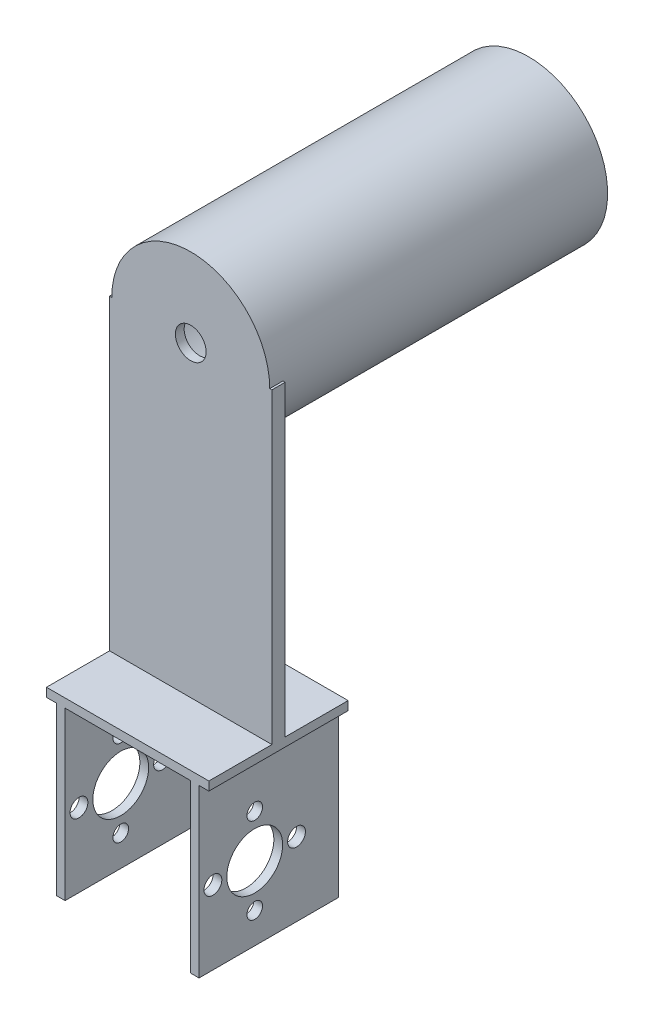
ISO-10303-21;
HEADER;
FILE_DESCRIPTION(('STEP AP214'),'2;1');
FILE_NAME('part.step','',(''),(''),'','','');
FILE_SCHEMA(('AUTOMOTIVE_DESIGN { 1 0 10303 214 1 1 1 1 }'));
ENDSEC;
DATA;
#1=APPLICATION_CONTEXT('core data for automotive mechanical design processes');
#2=APPLICATION_PROTOCOL_DEFINITION('international standard','automotive_design',2000,#1);
#3=PRODUCT_CONTEXT('',#1,'mechanical');
#4=PRODUCT('Part','Part','',(#3));
#5=PRODUCT_RELATED_PRODUCT_CATEGORY('part','',(#4));
#6=PRODUCT_DEFINITION_FORMATION('','',#4);
#7=PRODUCT_DEFINITION_CONTEXT('part definition',#1,'design');
#8=PRODUCT_DEFINITION('design','',#6,#7);
#9=PRODUCT_DEFINITION_SHAPE('','',#8);
#10=(LENGTH_UNIT() NAMED_UNIT(*) SI_UNIT(.MILLI.,.METRE.));
#11=(NAMED_UNIT(*) PLANE_ANGLE_UNIT() SI_UNIT($,.RADIAN.));
#12=(NAMED_UNIT(*) SI_UNIT($,.STERADIAN.) SOLID_ANGLE_UNIT());
#13=UNCERTAINTY_MEASURE_WITH_UNIT(LENGTH_MEASURE(1.E-05),#10,'distance_accuracy_value','');
#14=(GEOMETRIC_REPRESENTATION_CONTEXT(3) GLOBAL_UNCERTAINTY_ASSIGNED_CONTEXT((#13)) GLOBAL_UNIT_ASSIGNED_CONTEXT((#10,
#11,#12)) REPRESENTATION_CONTEXT('',''));
#15=CARTESIAN_POINT('',(0.,0.,0.));
#16=DIRECTION('',(0.,0.,1.));
#17=DIRECTION('',(1.,0.,0.));
#18=AXIS2_PLACEMENT_3D('',#15,#16,#17);
#19=CARTESIAN_POINT('',(0.,110.,0.));
#20=DIRECTION('',(0.,-1.,0.));
#21=DIRECTION('',(0.,0.,-1.));
#22=AXIS2_PLACEMENT_3D('',#19,#20,#21);
#23=PLANE('',#22);
#24=DIRECTION('',(1.,0.,0.));
#25=VECTOR('',#24,1.);
#26=CARTESIAN_POINT('',(-5.30632757811611,110.,16.162349726776));
#27=LINE('',#26,#25);
#28=CARTESIAN_POINT('',(-5.30632757811611,110.,16.162349726776));
#29=VERTEX_POINT('',#28);
#30=CARTESIAN_POINT('',(-4.80632757811611,110.,16.162349726776));
#31=VERTEX_POINT('',#30);
#32=EDGE_CURVE('E53',#29,#31,#27,.T.);
#33=ORIENTED_EDGE('',*,*,#32,.T.);
#34=DIRECTION('',(0.,0.,-1.));
#35=VECTOR('',#34,1.);
#36=CARTESIAN_POINT('',(-4.80632757811611,110.,16.162349726776));
#37=LINE('',#36,#35);
#38=CARTESIAN_POINT('',(-4.80632757811611,110.,13.162349726776));
#39=VERTEX_POINT('',#38);
#40=EDGE_CURVE('E11',#31,#39,#37,.T.);
#41=ORIENTED_EDGE('',*,*,#40,.T.);
#42=DIRECTION('',(-1.,0.,0.));
#43=VECTOR('',#42,1.);
#44=CARTESIAN_POINT('',(-5.30632757811611,110.,13.162349726776));
#45=LINE('',#44,#43);
#46=CARTESIAN_POINT('',(-5.30632757811611,110.,13.162349726776));
#47=VERTEX_POINT('',#46);
#48=EDGE_CURVE('E193',#39,#47,#45,.T.);
#49=ORIENTED_EDGE('',*,*,#48,.T.);
#50=DIRECTION('',(0.,0.,1.));
#51=VECTOR('',#50,1.);
#52=CARTESIAN_POINT('',(-5.30632757811611,110.,13.162349726776));
#53=LINE('',#52,#51);
#54=EDGE_CURVE('E170',#47,#29,#53,.T.);
#55=ORIENTED_EDGE('',*,*,#54,.T.);
#56=EDGE_LOOP('',(#33,#41,#49,#55));
#57=FACE_BOUND('',#56,.T.);
#58=ADVANCED_FACE('F37',(#57),#23,.F.);
#59=CARTESIAN_POINT('',(0.,40.,0.));
#60=DIRECTION('',(0.,1.,0.));
#61=DIRECTION('',(0.,0.,1.));
#62=AXIS2_PLACEMENT_3D('',#59,#60,#61);
#63=PLANE('',#62);
#64=DIRECTION('',(-1.,0.,0.));
#65=VECTOR('',#64,1.);
#66=CARTESIAN_POINT('',(-5.30632757811611,40.,13.162349726776));
#67=LINE('',#66,#65);
#68=CARTESIAN_POINT('',(31.6936724218839,40.,13.162349726776));
#69=VERTEX_POINT('',#68);
#70=CARTESIAN_POINT('',(-5.30632757811611,40.,13.162349726776));
#71=VERTEX_POINT('',#70);
#72=EDGE_CURVE('E185',#69,#71,#67,.T.);
#73=ORIENTED_EDGE('',*,*,#72,.F.);
#74=DIRECTION('',(0.,0.,-1.));
#75=VECTOR('',#74,1.);
#76=CARTESIAN_POINT('',(31.6936724218839,40.,-1.20765027322405));
#77=LINE('',#76,#75);
#78=CARTESIAN_POINT('',(31.6936724218839,40.,-1.20765027322405));
#79=VERTEX_POINT('',#78);
#80=EDGE_CURVE('E252',#69,#79,#77,.T.);
#81=ORIENTED_EDGE('',*,*,#80,.T.);
#82=DIRECTION('',(-1.,0.,0.));
#83=VECTOR('',#82,1.);
#84=CARTESIAN_POINT('',(-3.07432757811612,40.,-1.20765027322404));
#85=LINE('',#84,#83);
#86=CARTESIAN_POINT('',(-5.30632757811611,40.,-1.20765027322404));
#87=VERTEX_POINT('',#86);
#88=EDGE_CURVE('E273',#79,#87,#85,.T.);
#89=ORIENTED_EDGE('',*,*,#88,.T.);
#90=DIRECTION('',(0.,0.,1.));
#91=VECTOR('',#90,1.);
#92=CARTESIAN_POINT('',(-5.30632757811611,40.,-1.20765027322404));
#93=LINE('',#92,#91);
#94=EDGE_CURVE('E250',#87,#71,#93,.T.);
#95=ORIENTED_EDGE('',*,*,#94,.T.);
#96=EDGE_LOOP('',(#73,#81,#89,#95));
#97=FACE_BOUND('',#96,.T.);
#98=ADVANCED_FACE('F370',(#97),#63,.T.);
#99=CARTESIAN_POINT('',(0.,38.,0.));
#100=DIRECTION('',(0.,1.,0.));
#101=DIRECTION('',(0.,0.,1.));
#102=AXIS2_PLACEMENT_3D('',#99,#100,#101);
#103=PLANE('',#102);
#104=DIRECTION('',(0.,0.,-1.));
#105=VECTOR('',#104,1.);
#106=CARTESIAN_POINT('',(27.4536724218839,38.,0.));
#107=LINE('',#106,#105);
#108=CARTESIAN_POINT('',(27.4536724218839,38.,30.532349726776));
#109=VERTEX_POINT('',#108);
#110=CARTESIAN_POINT('',(27.4536724218839,38.,-1.20765027322405));
#111=VERTEX_POINT('',#110);
#112=EDGE_CURVE('E179',#109,#111,#107,.T.);
#113=ORIENTED_EDGE('',*,*,#112,.F.);
#114=DIRECTION('',(1.,0.,0.));
#115=VECTOR('',#114,1.);
#116=CARTESIAN_POINT('',(-5.30632757811611,38.,30.532349726776));
#117=LINE('',#116,#115);
#118=CARTESIAN_POINT('',(-1.07432757811612,38.,30.532349726776));
#119=VERTEX_POINT('',#118);
#120=EDGE_CURVE('E241',#119,#109,#117,.T.);
#121=ORIENTED_EDGE('',*,*,#120,.F.);
#122=DIRECTION('',(0.,0.,-1.));
#123=VECTOR('',#122,1.);
#124=CARTESIAN_POINT('',(-1.07432757811612,38.,-1.20765027322404));
#125=LINE('',#124,#123);
#126=CARTESIAN_POINT('',(-1.07432757811612,38.,-1.20765027322404));
#127=VERTEX_POINT('',#126);
#128=EDGE_CURVE('E257',#119,#127,#125,.T.);
#129=ORIENTED_EDGE('',*,*,#128,.T.);
#130=DIRECTION('',(-1.,0.,0.));
#131=VECTOR('',#130,1.);
#132=CARTESIAN_POINT('',(-5.30632757811611,38.,-1.20765027322404));
#133=LINE('',#132,#131);
#134=EDGE_CURVE('E249',#111,#127,#133,.T.);
#135=ORIENTED_EDGE('',*,*,#134,.F.);
#136=EDGE_LOOP('',(#113,#121,#129,#135));
#137=FACE_BOUND('',#136,.T.);
#138=ADVANCED_FACE('F374',(#137),#103,.F.);
#139=DIRECTION('',(0.,0.,1.));
#140=VECTOR('',#139,1.);
#141=CARTESIAN_POINT('',(29.4536724218839,38.,0.));
#142=LINE('',#141,#140);
#143=CARTESIAN_POINT('',(29.4536724218839,38.,-1.20765027322405));
#144=VERTEX_POINT('',#143);
#145=CARTESIAN_POINT('',(29.4536724218839,38.,30.532349726776));
#146=VERTEX_POINT('',#145);
#147=EDGE_CURVE('E294',#144,#146,#142,.T.);
#148=ORIENTED_EDGE('',*,*,#147,.F.);
#149=CARTESIAN_POINT('',(31.6936724218839,38.,-1.20765027322405));
#150=VERTEX_POINT('',#149);
#151=EDGE_CURVE('E245',#150,#144,#133,.T.);
#152=ORIENTED_EDGE('',*,*,#151,.F.);
#153=DIRECTION('',(0.,0.,-1.));
#154=VECTOR('',#153,1.);
#155=CARTESIAN_POINT('',(31.6936724218839,38.,-1.20765027322405));
#156=LINE('',#155,#154);
#157=CARTESIAN_POINT('',(31.6936724218839,38.,30.532349726776));
#158=VERTEX_POINT('',#157);
#159=EDGE_CURVE('E240',#158,#150,#156,.T.);
#160=ORIENTED_EDGE('',*,*,#159,.F.);
#161=EDGE_CURVE('E235',#146,#158,#117,.T.);
#162=ORIENTED_EDGE('',*,*,#161,.F.);
#163=EDGE_LOOP('',(#148,#152,#160,#162));
#164=FACE_BOUND('',#163,.T.);
#165=ADVANCED_FACE('F404',(#164),#103,.F.);
#166=CARTESIAN_POINT('',(-3.07432757811612,40.,-1.20765027322404));
#167=DIRECTION('',(1.,0.,0.));
#168=DIRECTION('',(0.,0.,-1.));
#169=AXIS2_PLACEMENT_3D('',#166,#167,#168);
#170=PLANE('',#169);
#171=CARTESIAN_POINT('',(-3.07432757811612,26.5588781391116,17.8423497267726));
#172=DIRECTION('',(1.,0.,0.));
#173=DIRECTION('',(0.,0.,-1.));
#174=AXIS2_PLACEMENT_3D('',#171,#172,#173);
#175=CIRCLE('',#174,1.78);
#176=CARTESIAN_POINT('',(-3.07432757811612,26.5588781391116,16.0623497267726));
#177=VERTEX_POINT('',#176);
#178=EDGE_CURVE('E346',#177,#177,#175,.T.);
#179=ORIENTED_EDGE('',*,*,#178,.T.);
#180=EDGE_LOOP('',(#179));
#181=FACE_BOUND('',#180,.T.);
#182=CARTESIAN_POINT('',(-3.07432757811612,7.00087813911163,17.8423497267726));
#183=DIRECTION('',(1.,0.,0.));
#184=DIRECTION('',(0.,0.,-1.));
#185=AXIS2_PLACEMENT_3D('',#182,#183,#184);
#186=CIRCLE('',#185,1.78);
#187=CARTESIAN_POINT('',(-3.07432757811612,7.00087813911163,16.0623497267726));
#188=VERTEX_POINT('',#187);
#189=EDGE_CURVE('E337',#188,#188,#186,.T.);
#190=ORIENTED_EDGE('',*,*,#189,.T.);
#191=EDGE_LOOP('',(#190));
#192=FACE_BOUND('',#191,.T.);
#193=CARTESIAN_POINT('',(-3.07432757811612,16.7798781391116,27.3673497267725));
#194=DIRECTION('',(1.,0.,0.));
#195=DIRECTION('',(0.,0.,-1.));
#196=AXIS2_PLACEMENT_3D('',#193,#194,#195);
#197=CIRCLE('',#196,2.03);
#198=CARTESIAN_POINT('',(-3.07432757811612,16.7798781391116,25.3373497267725));
#199=VERTEX_POINT('',#198);
#200=EDGE_CURVE('E320',#199,#199,#197,.T.);
#201=ORIENTED_EDGE('',*,*,#200,.T.);
#202=EDGE_LOOP('',(#201));
#203=FACE_BOUND('',#202,.T.);
#204=CARTESIAN_POINT('',(-3.07432757811612,16.7798781391116,8.31734972677252));
#205=DIRECTION('',(1.,0.,0.));
#206=DIRECTION('',(0.,0.,-1.));
#207=AXIS2_PLACEMENT_3D('',#204,#205,#206);
#208=CIRCLE('',#207,2.03);
#209=CARTESIAN_POINT('',(-3.07432757811612,16.7798781391116,6.28734972677252));
#210=VERTEX_POINT('',#209);
#211=EDGE_CURVE('E316',#210,#210,#208,.T.);
#212=ORIENTED_EDGE('',*,*,#211,.T.);
#213=EDGE_LOOP('',(#212));
#214=FACE_BOUND('',#213,.T.);
#215=CARTESIAN_POINT('',(-3.07432757811612,16.7798781391116,17.8423497267726));
#216=DIRECTION('',(1.,0.,0.));
#217=DIRECTION('',(0.,0.,-1.));
#218=AXIS2_PLACEMENT_3D('',#215,#216,#217);
#219=CIRCLE('',#218,6.36);
#220=CARTESIAN_POINT('',(-3.07432757811612,16.7798781391116,11.4823497267726));
#221=VERTEX_POINT('',#220);
#222=EDGE_CURVE('E312',#221,#221,#219,.T.);
#223=ORIENTED_EDGE('',*,*,#222,.T.);
#224=EDGE_LOOP('',(#223));
#225=FACE_BOUND('',#224,.T.);
#226=DIRECTION('',(0.,0.,1.));
#227=VECTOR('',#226,1.);
#228=CARTESIAN_POINT('',(-3.07432757811612,38.,-1.20765027322404));
#229=LINE('',#228,#227);
#230=CARTESIAN_POINT('',(-3.07432757811612,38.,-1.20765027322404));
#231=VERTEX_POINT('',#230);
#232=CARTESIAN_POINT('',(-3.07432757811612,38.,30.532349726776));
#233=VERTEX_POINT('',#232);
#234=EDGE_CURVE('E268',#231,#233,#229,.T.);
#235=ORIENTED_EDGE('',*,*,#234,.F.);
#236=DIRECTION('',(0.,-1.,0.));
#237=VECTOR('',#236,1.);
#238=CARTESIAN_POINT('',(-3.07432757811612,40.,-1.20765027322404));
#239=LINE('',#238,#237);
#240=CARTESIAN_POINT('',(-3.07432757811612,0.,-1.20765027322404));
#241=VERTEX_POINT('',#240);
#242=EDGE_CURVE('E276',#231,#241,#239,.T.);
#243=ORIENTED_EDGE('',*,*,#242,.T.);
#244=DIRECTION('',(0.,0.,1.));
#245=VECTOR('',#244,1.);
#246=CARTESIAN_POINT('',(-3.07432757811612,0.,-1.20765027322404));
#247=LINE('',#246,#245);
#248=CARTESIAN_POINT('',(-3.07432757811612,0.,30.532349726776));
#249=VERTEX_POINT('',#248);
#250=EDGE_CURVE('E270',#241,#249,#247,.T.);
#251=ORIENTED_EDGE('',*,*,#250,.T.);
#252=DIRECTION('',(0.,-1.,0.));
#253=VECTOR('',#252,1.);
#254=CARTESIAN_POINT('',(-3.07432757811612,40.,30.532349726776));
#255=LINE('',#254,#253);
#256=EDGE_CURVE('E292',#233,#249,#255,.T.);
#257=ORIENTED_EDGE('',*,*,#256,.F.);
#258=EDGE_LOOP('',(#235,#243,#251,#257));
#259=FACE_BOUND('',#258,.T.);
#260=ADVANCED_FACE('F39',(#181,#192,#203,#214,#225,#259),#170,.F.);
#261=CARTESIAN_POINT('',(-1.07432757811612,40.,-1.20765027322404));
#262=DIRECTION('',(-1.,0.,0.));
#263=DIRECTION('',(0.,0.,1.));
#264=AXIS2_PLACEMENT_3D('',#261,#262,#263);
#265=PLANE('',#264);
#266=CARTESIAN_POINT('',(-1.07432757811612,26.5588781391116,17.8423497267726));
#267=DIRECTION('',(-1.,0.,0.));
#268=DIRECTION('',(0.,0.,1.));
#269=AXIS2_PLACEMENT_3D('',#266,#267,#268);
#270=CIRCLE('',#269,1.78);
#271=CARTESIAN_POINT('',(-1.07432757811612,26.5588781391116,19.6223497267726));
#272=VERTEX_POINT('',#271);
#273=EDGE_CURVE('E343',#272,#272,#270,.T.);
#274=ORIENTED_EDGE('',*,*,#273,.T.);
#275=EDGE_LOOP('',(#274));
#276=FACE_BOUND('',#275,.T.);
#277=CARTESIAN_POINT('',(-1.07432757811612,7.00087813911163,17.8423497267726));
#278=DIRECTION('',(-1.,0.,0.));
#279=DIRECTION('',(0.,0.,1.));
#280=AXIS2_PLACEMENT_3D('',#277,#278,#279);
#281=CIRCLE('',#280,1.78);
#282=CARTESIAN_POINT('',(-1.07432757811612,7.00087813911163,19.6223497267726));
#283=VERTEX_POINT('',#282);
#284=EDGE_CURVE('E324',#283,#283,#281,.T.);
#285=ORIENTED_EDGE('',*,*,#284,.T.);
#286=EDGE_LOOP('',(#285));
#287=FACE_BOUND('',#286,.T.);
#288=CARTESIAN_POINT('',(-1.07432757811612,16.7798781391116,27.3673497267725));
#289=DIRECTION('',(-1.,0.,0.));
#290=DIRECTION('',(0.,0.,1.));
#291=AXIS2_PLACEMENT_3D('',#288,#289,#290);
#292=CIRCLE('',#291,2.03);
#293=CARTESIAN_POINT('',(-1.07432757811612,16.7798781391116,29.3973497267725));
#294=VERTEX_POINT('',#293);
#295=EDGE_CURVE('E327',#294,#294,#292,.T.);
#296=ORIENTED_EDGE('',*,*,#295,.T.);
#297=EDGE_LOOP('',(#296));
#298=FACE_BOUND('',#297,.T.);
#299=CARTESIAN_POINT('',(-1.07432757811612,16.7798781391116,8.31734972677252));
#300=DIRECTION('',(-1.,0.,0.));
#301=DIRECTION('',(0.,0.,1.));
#302=AXIS2_PLACEMENT_3D('',#299,#300,#301);
#303=CIRCLE('',#302,2.03);
#304=CARTESIAN_POINT('',(-1.07432757811612,16.7798781391116,10.3473497267725));
#305=VERTEX_POINT('',#304);
#306=EDGE_CURVE('E751',#305,#305,#303,.T.);
#307=ORIENTED_EDGE('',*,*,#306,.T.);
#308=EDGE_LOOP('',(#307));
#309=FACE_BOUND('',#308,.T.);
#310=CARTESIAN_POINT('',(-1.07432757811612,16.7798781391116,17.8423497267726));
#311=DIRECTION('',(-1.,0.,0.));
#312=DIRECTION('',(0.,0.,1.));
#313=AXIS2_PLACEMENT_3D('',#310,#311,#312);
#314=CIRCLE('',#313,6.36);
#315=CARTESIAN_POINT('',(-1.07432757811612,16.7798781391116,24.2023497267726));
#316=VERTEX_POINT('',#315);
#317=EDGE_CURVE('E743',#316,#316,#314,.T.);
#318=ORIENTED_EDGE('',*,*,#317,.T.);
#319=EDGE_LOOP('',(#318));
#320=FACE_BOUND('',#319,.T.);
#321=ORIENTED_EDGE('',*,*,#128,.F.);
#322=DIRECTION('',(0.,-1.,0.));
#323=VECTOR('',#322,1.);
#324=CARTESIAN_POINT('',(-1.07432757811612,40.,30.532349726776));
#325=LINE('',#324,#323);
#326=CARTESIAN_POINT('',(-1.07432757811612,0.,30.532349726776));
#327=VERTEX_POINT('',#326);
#328=EDGE_CURVE('E290',#119,#327,#325,.T.);
#329=ORIENTED_EDGE('',*,*,#328,.T.);
#330=DIRECTION('',(0.,0.,-1.));
#331=VECTOR('',#330,1.);
#332=CARTESIAN_POINT('',(-1.07432757811612,0.,-1.20765027322404));
#333=LINE('',#332,#331);
#334=CARTESIAN_POINT('',(-1.07432757811612,0.,-1.20765027322404));
#335=VERTEX_POINT('',#334);
#336=EDGE_CURVE('E282',#327,#335,#333,.T.);
#337=ORIENTED_EDGE('',*,*,#336,.T.);
#338=DIRECTION('',(0.,-1.,0.));
#339=VECTOR('',#338,1.);
#340=CARTESIAN_POINT('',(-1.07432757811612,40.,-1.20765027322404));
#341=LINE('',#340,#339);
#342=EDGE_CURVE('E288',#127,#335,#341,.T.);
#343=ORIENTED_EDGE('',*,*,#342,.F.);
#344=EDGE_LOOP('',(#321,#329,#337,#343));
#345=FACE_BOUND('',#344,.T.);
#346=ADVANCED_FACE('F422',(#276,#287,#298,#309,#320,#345),#265,.F.);
#347=CARTESIAN_POINT('',(-3.07432757811612,40.,30.532349726776));
#348=DIRECTION('',(0.,0.,-1.));
#349=DIRECTION('',(-1.,0.,0.));
#350=AXIS2_PLACEMENT_3D('',#347,#348,#349);
#351=PLANE('',#350);
#352=DIRECTION('',(0.,1.,0.));
#353=VECTOR('',#352,1.);
#354=CARTESIAN_POINT('',(31.6936724218839,38.,30.532349726776));
#355=LINE('',#354,#353);
#356=CARTESIAN_POINT('',(31.6936724218839,40.,30.532349726776));
#357=VERTEX_POINT('',#356);
#358=EDGE_CURVE('E261',#158,#357,#355,.T.);
#359=ORIENTED_EDGE('',*,*,#358,.T.);
#360=DIRECTION('',(1.,0.,0.));
#361=VECTOR('',#360,1.);
#362=CARTESIAN_POINT('',(-3.07432757811612,40.,30.532349726776));
#363=LINE('',#362,#361);
#364=CARTESIAN_POINT('',(-5.30632757811611,40.,30.532349726776));
#365=VERTEX_POINT('',#364);
#366=EDGE_CURVE('E271',#365,#357,#363,.T.);
#367=ORIENTED_EDGE('',*,*,#366,.F.);
#368=DIRECTION('',(0.,1.,0.));
#369=VECTOR('',#368,1.);
#370=CARTESIAN_POINT('',(-5.30632757811611,38.,30.532349726776));
#371=LINE('',#370,#369);
#372=CARTESIAN_POINT('',(-5.30632757811611,38.,30.532349726776));
#373=VERTEX_POINT('',#372);
#374=EDGE_CURVE('E248',#373,#365,#371,.T.);
#375=ORIENTED_EDGE('',*,*,#374,.F.);
#376=EDGE_CURVE('E237',#373,#233,#117,.T.);
#377=ORIENTED_EDGE('',*,*,#376,.T.);
#378=ORIENTED_EDGE('',*,*,#256,.T.);
#379=DIRECTION('',(1.,0.,0.));
#380=VECTOR('',#379,1.);
#381=CARTESIAN_POINT('',(-3.07432757811612,0.,30.532349726776));
#382=LINE('',#381,#380);
#383=EDGE_CURVE('E279',#249,#327,#382,.T.);
#384=ORIENTED_EDGE('',*,*,#383,.T.);
#385=ORIENTED_EDGE('',*,*,#328,.F.);
#386=ORIENTED_EDGE('',*,*,#120,.T.);
#387=DIRECTION('',(0.,-1.,0.));
#388=VECTOR('',#387,1.);
#389=CARTESIAN_POINT('',(27.4536724218839,40.,30.532349726776));
#390=LINE('',#389,#388);
#391=CARTESIAN_POINT('',(27.4536724218839,0.,30.532349726776));
#392=VERTEX_POINT('',#391);
#393=EDGE_CURVE('E213',#109,#392,#390,.T.);
#394=ORIENTED_EDGE('',*,*,#393,.T.);
#395=DIRECTION('',(1.,0.,0.));
#396=VECTOR('',#395,1.);
#397=CARTESIAN_POINT('',(29.4536724218839,0.,30.532349726776));
#398=LINE('',#397,#396);
#399=CARTESIAN_POINT('',(29.4536724218839,0.,30.532349726776));
#400=VERTEX_POINT('',#399);
#401=EDGE_CURVE('E222',#392,#400,#398,.T.);
#402=ORIENTED_EDGE('',*,*,#401,.T.);
#403=DIRECTION('',(0.,-1.,0.));
#404=VECTOR('',#403,1.);
#405=CARTESIAN_POINT('',(29.4536724218839,40.,30.532349726776));
#406=LINE('',#405,#404);
#407=EDGE_CURVE('E215',#146,#400,#406,.T.);
#408=ORIENTED_EDGE('',*,*,#407,.F.);
#409=ORIENTED_EDGE('',*,*,#161,.T.);
#410=EDGE_LOOP('',(#359,#367,#375,#377,#378,#384,#385,#386,#394,#402,#408,#409));
#411=FACE_BOUND('',#410,.T.);
#412=ADVANCED_FACE('F420',(#411),#351,.F.);
#413=CARTESIAN_POINT('',(-3.07432757811612,40.,-1.20765027322404));
#414=DIRECTION('',(0.,0.,1.));
#415=DIRECTION('',(1.,0.,0.));
#416=AXIS2_PLACEMENT_3D('',#413,#414,#415);
#417=PLANE('',#416);
#418=DIRECTION('',(0.,1.,0.));
#419=VECTOR('',#418,1.);
#420=CARTESIAN_POINT('',(-5.30632757811611,38.,-1.20765027322404));
#421=LINE('',#420,#419);
#422=CARTESIAN_POINT('',(-5.30632757811611,38.,-1.20765027322404));
#423=VERTEX_POINT('',#422);
#424=EDGE_CURVE('E254',#423,#87,#421,.T.);
#425=ORIENTED_EDGE('',*,*,#424,.T.);
#426=ORIENTED_EDGE('',*,*,#88,.F.);
#427=DIRECTION('',(0.,1.,0.));
#428=VECTOR('',#427,1.);
#429=CARTESIAN_POINT('',(31.6936724218839,38.,-1.20765027322405));
#430=LINE('',#429,#428);
#431=EDGE_CURVE('E258',#150,#79,#430,.T.);
#432=ORIENTED_EDGE('',*,*,#431,.F.);
#433=ORIENTED_EDGE('',*,*,#151,.T.);
#434=DIRECTION('',(0.,-1.,0.));
#435=VECTOR('',#434,1.);
#436=CARTESIAN_POINT('',(29.4536724218839,40.,-1.20765027322404));
#437=LINE('',#436,#435);
#438=CARTESIAN_POINT('',(29.4536724218839,0.,-1.20765027322404));
#439=VERTEX_POINT('',#438);
#440=EDGE_CURVE('E217',#144,#439,#437,.T.);
#441=ORIENTED_EDGE('',*,*,#440,.T.);
#442=DIRECTION('',(-1.,0.,0.));
#443=VECTOR('',#442,1.);
#444=CARTESIAN_POINT('',(29.4536724218839,0.,-1.20765027322404));
#445=LINE('',#444,#443);
#446=CARTESIAN_POINT('',(27.4536724218839,0.,-1.20765027322404));
#447=VERTEX_POINT('',#446);
#448=EDGE_CURVE('E228',#439,#447,#445,.T.);
#449=ORIENTED_EDGE('',*,*,#448,.T.);
#450=DIRECTION('',(0.,-1.,0.));
#451=VECTOR('',#450,1.);
#452=CARTESIAN_POINT('',(27.4536724218839,40.,-1.20765027322404));
#453=LINE('',#452,#451);
#454=EDGE_CURVE('E211',#111,#447,#453,.T.);
#455=ORIENTED_EDGE('',*,*,#454,.F.);
#456=ORIENTED_EDGE('',*,*,#134,.T.);
#457=ORIENTED_EDGE('',*,*,#342,.T.);
#458=DIRECTION('',(-1.,0.,0.));
#459=VECTOR('',#458,1.);
#460=CARTESIAN_POINT('',(-3.07432757811612,0.,-1.20765027322404));
#461=LINE('',#460,#459);
#462=EDGE_CURVE('E274',#335,#241,#461,.T.);
#463=ORIENTED_EDGE('',*,*,#462,.T.);
#464=ORIENTED_EDGE('',*,*,#242,.F.);
#465=EDGE_CURVE('E244',#231,#423,#133,.T.);
#466=ORIENTED_EDGE('',*,*,#465,.T.);
#467=EDGE_LOOP('',(#425,#426,#432,#433,#441,#449,#455,#456,#457,#463,#464,#466));
#468=FACE_BOUND('',#467,.T.);
#469=ADVANCED_FACE('F413',(#468),#417,.F.);
#470=DIRECTION('',(1.,0.,0.));
#471=VECTOR('',#470,1.);
#472=CARTESIAN_POINT('',(-5.30632757811611,40.,16.162349726776));
#473=LINE('',#472,#471);
#474=CARTESIAN_POINT('',(-5.30632757811611,40.,16.162349726776));
#475=VERTEX_POINT('',#474);
#476=CARTESIAN_POINT('',(31.6936724218839,40.,16.1623497267759));
#477=VERTEX_POINT('',#476);
#478=EDGE_CURVE('E200',#475,#477,#473,.T.);
#479=ORIENTED_EDGE('',*,*,#478,.F.);
#480=EDGE_CURVE('E231',#475,#365,#93,.T.);
#481=ORIENTED_EDGE('',*,*,#480,.T.);
#482=ORIENTED_EDGE('',*,*,#366,.T.);
#483=EDGE_CURVE('E236',#357,#477,#77,.T.);
#484=ORIENTED_EDGE('',*,*,#483,.T.);
#485=EDGE_LOOP('',(#479,#481,#482,#484));
#486=FACE_BOUND('',#485,.T.);
#487=ADVANCED_FACE('F377',(#486),#63,.T.);
#488=CARTESIAN_POINT('',(0.,0.,0.));
#489=DIRECTION('',(0.,1.,0.));
#490=DIRECTION('',(0.,0.,1.));
#491=AXIS2_PLACEMENT_3D('',#488,#489,#490);
#492=PLANE('',#491);
#493=ORIENTED_EDGE('',*,*,#250,.F.);
#494=ORIENTED_EDGE('',*,*,#462,.F.);
#495=ORIENTED_EDGE('',*,*,#336,.F.);
#496=ORIENTED_EDGE('',*,*,#383,.F.);
#497=EDGE_LOOP('',(#493,#494,#495,#496));
#498=FACE_BOUND('',#497,.T.);
#499=ADVANCED_FACE('F407',(#498),#492,.F.);
#500=CARTESIAN_POINT('',(31.6936724218839,38.,-1.20765027322405));
#501=DIRECTION('',(1.,0.,0.));
#502=DIRECTION('',(0.,0.,-1.));
#503=AXIS2_PLACEMENT_3D('',#500,#501,#502);
#504=PLANE('',#503);
#505=ORIENTED_EDGE('',*,*,#483,.F.);
#506=ORIENTED_EDGE('',*,*,#358,.F.);
#507=ORIENTED_EDGE('',*,*,#159,.T.);
#508=ORIENTED_EDGE('',*,*,#431,.T.);
#509=ORIENTED_EDGE('',*,*,#80,.F.);
#510=DIRECTION('',(0.,-1.,0.));
#511=VECTOR('',#510,1.);
#512=CARTESIAN_POINT('',(31.6936724218839,110.,13.162349726776));
#513=LINE('',#512,#511);
#514=CARTESIAN_POINT('',(31.6936724218839,110.,13.162349726776));
#515=VERTEX_POINT('',#514);
#516=EDGE_CURVE('E197',#515,#69,#513,.T.);
#517=ORIENTED_EDGE('',*,*,#516,.F.);
#518=DIRECTION('',(0.,0.,-1.));
#519=VECTOR('',#518,1.);
#520=CARTESIAN_POINT('',(31.6936724218839,110.,13.162349726776));
#521=LINE('',#520,#519);
#522=CARTESIAN_POINT('',(31.6936724218839,110.,16.1623497267759));
#523=VERTEX_POINT('',#522);
#524=EDGE_CURVE('E195',#523,#515,#521,.T.);
#525=ORIENTED_EDGE('',*,*,#524,.F.);
#526=DIRECTION('',(0.,-1.,0.));
#527=VECTOR('',#526,1.);
#528=CARTESIAN_POINT('',(31.6936724218839,110.,16.1623497267759));
#529=LINE('',#528,#527);
#530=EDGE_CURVE('E167',#523,#477,#529,.T.);
#531=ORIENTED_EDGE('',*,*,#530,.T.);
#532=EDGE_LOOP('',(#505,#506,#507,#508,#509,#517,#525,#531));
#533=FACE_BOUND('',#532,.T.);
#534=ADVANCED_FACE('F402',(#533),#504,.T.);
#535=ORIENTED_EDGE('',*,*,#465,.F.);
#536=ORIENTED_EDGE('',*,*,#234,.T.);
#537=ORIENTED_EDGE('',*,*,#376,.F.);
#538=DIRECTION('',(0.,0.,1.));
#539=VECTOR('',#538,1.);
#540=CARTESIAN_POINT('',(-5.30632757811611,38.,-1.20765027322404));
#541=LINE('',#540,#539);
#542=EDGE_CURVE('E232',#423,#373,#541,.T.);
#543=ORIENTED_EDGE('',*,*,#542,.F.);
#544=EDGE_LOOP('',(#535,#536,#537,#543));
#545=FACE_BOUND('',#544,.T.);
#546=ADVANCED_FACE('F399',(#545),#103,.F.);
#547=CARTESIAN_POINT('',(-5.30632757811611,38.,-1.20765027322404));
#548=DIRECTION('',(-1.,0.,0.));
#549=DIRECTION('',(0.,0.,1.));
#550=AXIS2_PLACEMENT_3D('',#547,#548,#549);
#551=PLANE('',#550);
#552=ORIENTED_EDGE('',*,*,#94,.F.);
#553=ORIENTED_EDGE('',*,*,#424,.F.);
#554=ORIENTED_EDGE('',*,*,#542,.T.);
#555=ORIENTED_EDGE('',*,*,#374,.T.);
#556=ORIENTED_EDGE('',*,*,#480,.F.);
#557=DIRECTION('',(0.,-1.,0.));
#558=VECTOR('',#557,1.);
#559=CARTESIAN_POINT('',(-5.30632757811611,110.,16.162349726776));
#560=LINE('',#559,#558);
#561=EDGE_CURVE('E205',#29,#475,#560,.T.);
#562=ORIENTED_EDGE('',*,*,#561,.F.);
#563=ORIENTED_EDGE('',*,*,#54,.F.);
#564=DIRECTION('',(0.,-1.,0.));
#565=VECTOR('',#564,1.);
#566=CARTESIAN_POINT('',(-5.30632757811611,110.,13.162349726776));
#567=LINE('',#566,#565);
#568=EDGE_CURVE('E208',#47,#71,#567,.T.);
#569=ORIENTED_EDGE('',*,*,#568,.T.);
#570=EDGE_LOOP('',(#552,#553,#554,#555,#556,#562,#563,#569));
#571=FACE_BOUND('',#570,.T.);
#572=ADVANCED_FACE('F391',(#571),#551,.T.);
#573=CARTESIAN_POINT('',(27.4536724218839,40.,-1.20765027322404));
#574=DIRECTION('',(1.,0.,0.));
#575=DIRECTION('',(0.,0.,-1.));
#576=AXIS2_PLACEMENT_3D('',#573,#574,#575);
#577=PLANE('',#576);
#578=CARTESIAN_POINT('',(27.4536724218839,26.5588781391116,17.8423497267726));
#579=DIRECTION('',(1.,0.,0.));
#580=DIRECTION('',(0.,0.,-1.));
#581=AXIS2_PLACEMENT_3D('',#578,#579,#580);
#582=CIRCLE('',#581,1.78);
#583=CARTESIAN_POINT('',(27.4536724218839,26.5588781391116,16.0623497267726));
#584=VERTEX_POINT('',#583);
#585=EDGE_CURVE('E340',#584,#584,#582,.T.);
#586=ORIENTED_EDGE('',*,*,#585,.T.);
#587=EDGE_LOOP('',(#586));
#588=FACE_BOUND('',#587,.T.);
#589=CARTESIAN_POINT('',(27.4536724218839,7.00087813911163,17.8423497267726));
#590=DIRECTION('',(1.,0.,0.));
#591=DIRECTION('',(0.,0.,-1.));
#592=AXIS2_PLACEMENT_3D('',#589,#590,#591);
#593=CIRCLE('',#592,1.78);
#594=CARTESIAN_POINT('',(27.4536724218839,7.00087813911163,16.0623497267726));
#595=VERTEX_POINT('',#594);
#596=EDGE_CURVE('E319',#595,#595,#593,.T.);
#597=ORIENTED_EDGE('',*,*,#596,.T.);
#598=EDGE_LOOP('',(#597));
#599=FACE_BOUND('',#598,.T.);
#600=CARTESIAN_POINT('',(27.4536724218839,16.7798781391116,27.3673497267725));
#601=DIRECTION('',(1.,0.,0.));
#602=DIRECTION('',(0.,0.,-1.));
#603=AXIS2_PLACEMENT_3D('',#600,#601,#602);
#604=CIRCLE('',#603,2.03);
#605=CARTESIAN_POINT('',(27.4536724218839,16.7798781391116,25.3373497267725));
#606=VERTEX_POINT('',#605);
#607=EDGE_CURVE('E315',#606,#606,#604,.T.);
#608=ORIENTED_EDGE('',*,*,#607,.T.);
#609=EDGE_LOOP('',(#608));
#610=FACE_BOUND('',#609,.T.);
#611=CARTESIAN_POINT('',(27.4536724218839,16.7798781391116,8.31734972677252));
#612=DIRECTION('',(1.,0.,0.));
#613=DIRECTION('',(0.,0.,-1.));
#614=AXIS2_PLACEMENT_3D('',#611,#612,#613);
#615=CIRCLE('',#614,2.03);
#616=CARTESIAN_POINT('',(27.4536724218839,16.7798781391116,6.28734972677252));
#617=VERTEX_POINT('',#616);
#618=EDGE_CURVE('E311',#617,#617,#615,.T.);
#619=ORIENTED_EDGE('',*,*,#618,.T.);
#620=EDGE_LOOP('',(#619));
#621=FACE_BOUND('',#620,.T.);
#622=CARTESIAN_POINT('',(27.4536724218839,16.7798781391116,17.8423497267726));
#623=DIRECTION('',(1.,0.,0.));
#624=DIRECTION('',(0.,0.,-1.));
#625=AXIS2_PLACEMENT_3D('',#622,#623,#624);
#626=CIRCLE('',#625,6.36);
#627=CARTESIAN_POINT('',(27.4536724218839,16.7798781391116,11.4823497267726));
#628=VERTEX_POINT('',#627);
#629=EDGE_CURVE('E307',#628,#628,#626,.T.);
#630=ORIENTED_EDGE('',*,*,#629,.T.);
#631=EDGE_LOOP('',(#630));
#632=FACE_BOUND('',#631,.T.);
#633=ORIENTED_EDGE('',*,*,#393,.F.);
#634=ORIENTED_EDGE('',*,*,#112,.T.);
#635=ORIENTED_EDGE('',*,*,#454,.T.);
#636=DIRECTION('',(0.,0.,1.));
#637=VECTOR('',#636,1.);
#638=CARTESIAN_POINT('',(27.4536724218839,0.,-1.20765027322404));
#639=LINE('',#638,#637);
#640=EDGE_CURVE('E225',#447,#392,#639,.T.);
#641=ORIENTED_EDGE('',*,*,#640,.T.);
#642=EDGE_LOOP('',(#633,#634,#635,#641));
#643=FACE_BOUND('',#642,.T.);
#644=ADVANCED_FACE('F387',(#588,#599,#610,#621,#632,#643),#577,.F.);
#645=CARTESIAN_POINT('',(29.4536724218839,40.,-1.20765027322404));
#646=DIRECTION('',(-1.,0.,0.));
#647=DIRECTION('',(0.,0.,1.));
#648=AXIS2_PLACEMENT_3D('',#645,#646,#647);
#649=PLANE('',#648);
#650=CARTESIAN_POINT('',(29.4536724218839,26.5588781391116,17.8423497267726));
#651=DIRECTION('',(-1.,0.,0.));
#652=DIRECTION('',(0.,0.,1.));
#653=AXIS2_PLACEMENT_3D('',#650,#651,#652);
#654=CIRCLE('',#653,1.78);
#655=CARTESIAN_POINT('',(29.4536724218839,26.5588781391116,19.6223497267726));
#656=VERTEX_POINT('',#655);
#657=EDGE_CURVE('E41',#656,#656,#654,.T.);
#658=ORIENTED_EDGE('',*,*,#657,.T.);
#659=EDGE_LOOP('',(#658));
#660=FACE_BOUND('',#659,.T.);
#661=CARTESIAN_POINT('',(29.4536724218839,7.00087813911163,17.8423497267726));
#662=DIRECTION('',(-1.,0.,0.));
#663=DIRECTION('',(0.,0.,1.));
#664=AXIS2_PLACEMENT_3D('',#661,#662,#663);
#665=CIRCLE('',#664,1.78);
#666=CARTESIAN_POINT('',(29.4536724218839,7.00087813911163,19.6223497267726));
#667=VERTEX_POINT('',#666);
#668=EDGE_CURVE('E317',#667,#667,#665,.T.);
#669=ORIENTED_EDGE('',*,*,#668,.T.);
#670=EDGE_LOOP('',(#669));
#671=FACE_BOUND('',#670,.T.);
#672=CARTESIAN_POINT('',(29.4536724218839,16.7798781391116,27.3673497267725));
#673=DIRECTION('',(-1.,0.,0.));
#674=DIRECTION('',(0.,0.,1.));
#675=AXIS2_PLACEMENT_3D('',#672,#673,#674);
#676=CIRCLE('',#675,2.03);
#677=CARTESIAN_POINT('',(29.4536724218839,16.7798781391116,29.3973497267725));
#678=VERTEX_POINT('',#677);
#679=EDGE_CURVE('E313',#678,#678,#676,.T.);
#680=ORIENTED_EDGE('',*,*,#679,.T.);
#681=EDGE_LOOP('',(#680));
#682=FACE_BOUND('',#681,.T.);
#683=CARTESIAN_POINT('',(29.4536724218839,16.7798781391116,8.31734972677252));
#684=DIRECTION('',(-1.,0.,0.));
#685=DIRECTION('',(0.,0.,1.));
#686=AXIS2_PLACEMENT_3D('',#683,#684,#685);
#687=CIRCLE('',#686,2.03);
#688=CARTESIAN_POINT('',(29.4536724218839,16.7798781391116,10.3473497267725));
#689=VERTEX_POINT('',#688);
#690=EDGE_CURVE('E308',#689,#689,#687,.T.);
#691=ORIENTED_EDGE('',*,*,#690,.T.);
#692=EDGE_LOOP('',(#691));
#693=FACE_BOUND('',#692,.T.);
#694=CARTESIAN_POINT('',(29.4536724218839,16.7798781391116,17.8423497267726));
#695=DIRECTION('',(-1.,0.,0.));
#696=DIRECTION('',(0.,0.,1.));
#697=AXIS2_PLACEMENT_3D('',#694,#695,#696);
#698=CIRCLE('',#697,6.36);
#699=CARTESIAN_POINT('',(29.4536724218839,16.7798781391116,24.2023497267726));
#700=VERTEX_POINT('',#699);
#701=EDGE_CURVE('E304',#700,#700,#698,.T.);
#702=ORIENTED_EDGE('',*,*,#701,.T.);
#703=EDGE_LOOP('',(#702));
#704=FACE_BOUND('',#703,.T.);
#705=ORIENTED_EDGE('',*,*,#440,.F.);
#706=ORIENTED_EDGE('',*,*,#147,.T.);
#707=ORIENTED_EDGE('',*,*,#407,.T.);
#708=DIRECTION('',(0.,0.,-1.));
#709=VECTOR('',#708,1.);
#710=CARTESIAN_POINT('',(29.4536724218839,0.,-1.20765027322404));
#711=LINE('',#710,#709);
#712=EDGE_CURVE('E219',#400,#439,#711,.T.);
#713=ORIENTED_EDGE('',*,*,#712,.T.);
#714=EDGE_LOOP('',(#705,#706,#707,#713));
#715=FACE_BOUND('',#714,.T.);
#716=ADVANCED_FACE('F390',(#660,#671,#682,#693,#704,#715),#649,.F.);
#717=CARTESIAN_POINT('',(0.,0.,0.));
#718=DIRECTION('',(0.,1.,0.));
#719=DIRECTION('',(0.,0.,1.));
#720=AXIS2_PLACEMENT_3D('',#717,#718,#719);
#721=PLANE('',#720);
#722=ORIENTED_EDGE('',*,*,#448,.F.);
#723=ORIENTED_EDGE('',*,*,#712,.F.);
#724=ORIENTED_EDGE('',*,*,#401,.F.);
#725=ORIENTED_EDGE('',*,*,#640,.F.);
#726=EDGE_LOOP('',(#722,#723,#724,#725));
#727=FACE_BOUND('',#726,.T.);
#728=ADVANCED_FACE('F385',(#727),#721,.F.);
#729=CARTESIAN_POINT('',(-5.30632757811611,110.,13.162349726776));
#730=DIRECTION('',(0.,0.,1.));
#731=DIRECTION('',(1.,0.,0.));
#732=AXIS2_PLACEMENT_3D('',#729,#730,#731);
#733=PLANE('',#732);
#734=ORIENTED_EDGE('',*,*,#48,.F.);
#735=CARTESIAN_POINT('',(13.1936724218839,110.,13.162349726776));
#736=DIRECTION('',(0.,0.,1.));
#737=DIRECTION('',(1.,0.,0.));
#738=AXIS2_PLACEMENT_3D('',#735,#736,#737);
#739=CIRCLE('',#738,18.);
#740=CARTESIAN_POINT('',(31.1936724218839,110.,13.162349726776));
#741=VERTEX_POINT('',#740);
#742=EDGE_CURVE('E182',#39,#741,#739,.T.);
#743=ORIENTED_EDGE('',*,*,#742,.T.);
#744=EDGE_CURVE('E176',#515,#741,#45,.T.);
#745=ORIENTED_EDGE('',*,*,#744,.F.);
#746=ORIENTED_EDGE('',*,*,#516,.T.);
#747=ORIENTED_EDGE('',*,*,#72,.T.);
#748=ORIENTED_EDGE('',*,*,#568,.F.);
#749=EDGE_LOOP('',(#734,#743,#745,#746,#747,#748));
#750=FACE_BOUND('',#749,.T.);
#751=ADVANCED_FACE('F381',(#750),#733,.F.);
#752=CARTESIAN_POINT('',(-5.30632757811611,110.,16.162349726776));
#753=DIRECTION('',(0.,0.,-1.));
#754=DIRECTION('',(-1.,0.,0.));
#755=AXIS2_PLACEMENT_3D('',#752,#753,#754);
#756=PLANE('',#755);
#757=CARTESIAN_POINT('',(13.1936724218839,110.,16.162349726776));
#758=DIRECTION('',(0.,0.,-1.));
#759=DIRECTION('',(-1.,0.,0.));
#760=AXIS2_PLACEMENT_3D('',#757,#758,#759);
#761=CIRCLE('',#760,3.5);
#762=CARTESIAN_POINT('',(9.69367242188389,110.,16.162349726776));
#763=VERTEX_POINT('',#762);
#764=EDGE_CURVE('E299',#763,#763,#761,.T.);
#765=ORIENTED_EDGE('',*,*,#764,.T.);
#766=EDGE_LOOP('',(#765));
#767=FACE_BOUND('',#766,.T.);
#768=CARTESIAN_POINT('',(31.1936724218839,110.,16.162349726776));
#769=VERTEX_POINT('',#768);
#770=EDGE_CURVE('E160',#769,#523,#27,.T.);
#771=ORIENTED_EDGE('',*,*,#770,.F.);
#772=CARTESIAN_POINT('',(13.1936724218839,110.,16.162349726776));
#773=DIRECTION('',(0.,0.,-1.));
#774=DIRECTION('',(-1.,0.,0.));
#775=AXIS2_PLACEMENT_3D('',#772,#773,#774);
#776=CIRCLE('',#775,18.);
#777=EDGE_CURVE('E164',#31,#769,#776,.T.);
#778=ORIENTED_EDGE('',*,*,#777,.F.);
#779=ORIENTED_EDGE('',*,*,#32,.F.);
#780=ORIENTED_EDGE('',*,*,#561,.T.);
#781=ORIENTED_EDGE('',*,*,#478,.T.);
#782=ORIENTED_EDGE('',*,*,#530,.F.);
#783=EDGE_LOOP('',(#771,#778,#779,#780,#781,#782));
#784=FACE_BOUND('',#783,.T.);
#785=ADVANCED_FACE('F162',(#767,#784),#756,.F.);
#786=ORIENTED_EDGE('',*,*,#744,.T.);
#787=DIRECTION('',(0.,0.,-1.));
#788=VECTOR('',#787,1.);
#789=CARTESIAN_POINT('',(31.1936724218839,110.,16.162349726776));
#790=LINE('',#789,#788);
#791=EDGE_CURVE('E46',#741,#769,#790,.F.);
#792=ORIENTED_EDGE('',*,*,#791,.T.);
#793=ORIENTED_EDGE('',*,*,#770,.T.);
#794=ORIENTED_EDGE('',*,*,#524,.T.);
#795=EDGE_LOOP('',(#786,#792,#793,#794));
#796=FACE_BOUND('',#795,.T.);
#797=ADVANCED_FACE('F174',(#796),#23,.F.);
#798=CARTESIAN_POINT('',(13.1936724218839,110.,16.162349726776));
#799=DIRECTION('',(0.,0.,-1.));
#800=DIRECTION('',(-1.,0.,0.));
#801=AXIS2_PLACEMENT_3D('',#798,#799,#800);
#802=CYLINDRICAL_SURFACE('',#801,18.);
#803=CARTESIAN_POINT('',(13.1936724218839,110.,-60.837650273224));
#804=DIRECTION('',(0.,0.,-1.));
#805=DIRECTION('',(-1.,0.,0.));
#806=AXIS2_PLACEMENT_3D('',#803,#804,#805);
#807=CIRCLE('',#806,18.);
#808=CARTESIAN_POINT('',(-4.80632757811611,110.,-60.837650273224));
#809=VERTEX_POINT('',#808);
#810=EDGE_CURVE('E183',#809,#809,#807,.T.);
#811=ORIENTED_EDGE('',*,*,#810,.F.);
#812=EDGE_LOOP('',(#811));
#813=FACE_BOUND('',#812,.T.);
#814=ORIENTED_EDGE('',*,*,#40,.F.);
#815=ORIENTED_EDGE('',*,*,#777,.T.);
#816=ORIENTED_EDGE('',*,*,#791,.F.);
#817=ORIENTED_EDGE('',*,*,#742,.F.);
#818=EDGE_LOOP('',(#814,#815,#816,#817));
#819=FACE_BOUND('',#818,.T.);
#820=ADVANCED_FACE('F181',(#813,#819),#802,.T.);
#821=CARTESIAN_POINT('',(13.1936724218839,110.,-60.837650273224));
#822=DIRECTION('',(0.,0.,-1.));
#823=DIRECTION('',(-1.,0.,0.));
#824=AXIS2_PLACEMENT_3D('',#821,#822,#823);
#825=PLANE('',#824);
#826=CARTESIAN_POINT('',(13.1936724218839,110.,-60.837650273224));
#827=DIRECTION('',(0.,0.,-1.));
#828=DIRECTION('',(-1.,0.,0.));
#829=AXIS2_PLACEMENT_3D('',#826,#827,#828);
#830=CIRCLE('',#829,16.1);
#831=CARTESIAN_POINT('',(-2.90632757811611,110.,-60.837650273224));
#832=VERTEX_POINT('',#831);
#833=EDGE_CURVE('E302',#832,#832,#830,.T.);
#834=ORIENTED_EDGE('',*,*,#833,.F.);
#835=EDGE_LOOP('',(#834));
#836=FACE_BOUND('',#835,.T.);
#837=ORIENTED_EDGE('',*,*,#810,.T.);
#838=EDGE_LOOP('',(#837));
#839=FACE_BOUND('',#838,.T.);
#840=ADVANCED_FACE('F357',(#836,#839),#825,.T.);
#841=CARTESIAN_POINT('',(13.1936724218839,110.,14.162349726776));
#842=DIRECTION('',(0.,0.,-1.));
#843=DIRECTION('',(-1.,0.,0.));
#844=AXIS2_PLACEMENT_3D('',#841,#842,#843);
#845=CYLINDRICAL_SURFACE('',#844,16.1);
#846=CARTESIAN_POINT('',(13.1936724218839,110.,14.162349726776));
#847=DIRECTION('',(0.,0.,-1.));
#848=DIRECTION('',(-1.,0.,0.));
#849=AXIS2_PLACEMENT_3D('',#846,#847,#848);
#850=CIRCLE('',#849,16.1);
#851=CARTESIAN_POINT('',(-2.90632757811611,110.,14.162349726776));
#852=VERTEX_POINT('',#851);
#853=EDGE_CURVE('E188',#852,#852,#850,.T.);
#854=ORIENTED_EDGE('',*,*,#853,.F.);
#855=EDGE_LOOP('',(#854));
#856=FACE_BOUND('',#855,.T.);
#857=ORIENTED_EDGE('',*,*,#833,.T.);
#858=EDGE_LOOP('',(#857));
#859=FACE_BOUND('',#858,.T.);
#860=ADVANCED_FACE('F355',(#856,#859),#845,.F.);
#861=CARTESIAN_POINT('',(13.1936724218839,110.,14.162349726776));
#862=DIRECTION('',(0.,0.,-1.));
#863=DIRECTION('',(-1.,0.,0.));
#864=AXIS2_PLACEMENT_3D('',#861,#862,#863);
#865=PLANE('',#864);
#866=CARTESIAN_POINT('',(13.1936724218839,110.,14.162349726776));
#867=DIRECTION('',(0.,0.,-1.));
#868=DIRECTION('',(-1.,0.,0.));
#869=AXIS2_PLACEMENT_3D('',#866,#867,#868);
#870=CIRCLE('',#869,3.5);
#871=CARTESIAN_POINT('',(9.69367242188389,110.,14.162349726776));
#872=VERTEX_POINT('',#871);
#873=EDGE_CURVE('E303',#872,#872,#870,.T.);
#874=ORIENTED_EDGE('',*,*,#873,.F.);
#875=EDGE_LOOP('',(#874));
#876=FACE_BOUND('',#875,.T.);
#877=ORIENTED_EDGE('',*,*,#853,.T.);
#878=EDGE_LOOP('',(#877));
#879=FACE_BOUND('',#878,.T.);
#880=ADVANCED_FACE('F551',(#876,#879),#865,.T.);
#881=CARTESIAN_POINT('',(13.1936724218839,110.,88.1623497267759));
#882=DIRECTION('',(0.,0.,-1.));
#883=DIRECTION('',(-1.,0.,0.));
#884=AXIS2_PLACEMENT_3D('',#881,#882,#883);
#885=CYLINDRICAL_SURFACE('',#884,3.5);
#886=ORIENTED_EDGE('',*,*,#873,.T.);
#887=EDGE_LOOP('',(#886));
#888=FACE_BOUND('',#887,.T.);
#889=ORIENTED_EDGE('',*,*,#764,.F.);
#890=EDGE_LOOP('',(#889));
#891=FACE_BOUND('',#890,.T.);
#892=ADVANCED_FACE('F567',(#888,#891),#885,.F.);
#893=CARTESIAN_POINT('',(-5.30632757811612,16.7798781391116,17.8423497267726));
#894=DIRECTION('',(1.,0.,0.));
#895=DIRECTION('',(0.,0.,-1.));
#896=AXIS2_PLACEMENT_3D('',#893,#894,#895);
#897=CYLINDRICAL_SURFACE('',#896,6.36);
#898=ORIENTED_EDGE('',*,*,#701,.F.);
#899=EDGE_LOOP('',(#898));
#900=FACE_BOUND('',#899,.T.);
#901=ORIENTED_EDGE('',*,*,#629,.F.);
#902=EDGE_LOOP('',(#901));
#903=FACE_BOUND('',#902,.T.);
#904=ADVANCED_FACE('F578',(#900,#903),#897,.F.);
#905=CARTESIAN_POINT('',(-5.30632757811612,16.7798781391116,8.31734972677252));
#906=DIRECTION('',(1.,0.,0.));
#907=DIRECTION('',(0.,0.,-1.));
#908=AXIS2_PLACEMENT_3D('',#905,#906,#907);
#909=CYLINDRICAL_SURFACE('',#908,2.03);
#910=ORIENTED_EDGE('',*,*,#690,.F.);
#911=EDGE_LOOP('',(#910));
#912=FACE_BOUND('',#911,.T.);
#913=ORIENTED_EDGE('',*,*,#618,.F.);
#914=EDGE_LOOP('',(#913));
#915=FACE_BOUND('',#914,.T.);
#916=ADVANCED_FACE('F617',(#912,#915),#909,.F.);
#917=CARTESIAN_POINT('',(-5.30632757811612,16.7798781391116,27.3673497267725));
#918=DIRECTION('',(1.,0.,0.));
#919=DIRECTION('',(0.,0.,-1.));
#920=AXIS2_PLACEMENT_3D('',#917,#918,#919);
#921=CYLINDRICAL_SURFACE('',#920,2.03);
#922=ORIENTED_EDGE('',*,*,#679,.F.);
#923=EDGE_LOOP('',(#922));
#924=FACE_BOUND('',#923,.T.);
#925=ORIENTED_EDGE('',*,*,#607,.F.);
#926=EDGE_LOOP('',(#925));
#927=FACE_BOUND('',#926,.T.);
#928=ADVANCED_FACE('F629',(#924,#927),#921,.F.);
#929=CARTESIAN_POINT('',(-5.30632757811612,7.00087813911163,17.8423497267726));
#930=DIRECTION('',(1.,0.,0.));
#931=DIRECTION('',(0.,0.,-1.));
#932=AXIS2_PLACEMENT_3D('',#929,#930,#931);
#933=CYLINDRICAL_SURFACE('',#932,1.78);
#934=ORIENTED_EDGE('',*,*,#668,.F.);
#935=EDGE_LOOP('',(#934));
#936=FACE_BOUND('',#935,.T.);
#937=ORIENTED_EDGE('',*,*,#596,.F.);
#938=EDGE_LOOP('',(#937));
#939=FACE_BOUND('',#938,.T.);
#940=ADVANCED_FACE('F641',(#936,#939),#933,.F.);
#941=CARTESIAN_POINT('',(-5.30632757811612,26.5588781391116,17.8423497267726));
#942=DIRECTION('',(1.,0.,0.));
#943=DIRECTION('',(0.,0.,-1.));
#944=AXIS2_PLACEMENT_3D('',#941,#942,#943);
#945=CYLINDRICAL_SURFACE('',#944,1.78);
#946=ORIENTED_EDGE('',*,*,#657,.F.);
#947=EDGE_LOOP('',(#946));
#948=FACE_BOUND('',#947,.T.);
#949=ORIENTED_EDGE('',*,*,#585,.F.);
#950=EDGE_LOOP('',(#949));
#951=FACE_BOUND('',#950,.T.);
#952=ADVANCED_FACE('F653',(#948,#951),#945,.F.);
#953=ORIENTED_EDGE('',*,*,#317,.F.);
#954=EDGE_LOOP('',(#953));
#955=FACE_BOUND('',#954,.T.);
#956=ORIENTED_EDGE('',*,*,#222,.F.);
#957=EDGE_LOOP('',(#956));
#958=FACE_BOUND('',#957,.T.);
#959=ADVANCED_FACE('F620',(#955,#958),#897,.F.);
#960=ORIENTED_EDGE('',*,*,#306,.F.);
#961=EDGE_LOOP('',(#960));
#962=FACE_BOUND('',#961,.T.);
#963=ORIENTED_EDGE('',*,*,#211,.F.);
#964=EDGE_LOOP('',(#963));
#965=FACE_BOUND('',#964,.T.);
#966=ADVANCED_FACE('F632',(#962,#965),#909,.F.);
#967=ORIENTED_EDGE('',*,*,#295,.F.);
#968=EDGE_LOOP('',(#967));
#969=FACE_BOUND('',#968,.T.);
#970=ORIENTED_EDGE('',*,*,#200,.F.);
#971=EDGE_LOOP('',(#970));
#972=FACE_BOUND('',#971,.T.);
#973=ADVANCED_FACE('F644',(#969,#972),#921,.F.);
#974=ORIENTED_EDGE('',*,*,#284,.F.);
#975=EDGE_LOOP('',(#974));
#976=FACE_BOUND('',#975,.T.);
#977=ORIENTED_EDGE('',*,*,#189,.F.);
#978=EDGE_LOOP('',(#977));
#979=FACE_BOUND('',#978,.T.);
#980=ADVANCED_FACE('F656',(#976,#979),#933,.F.);
#981=ORIENTED_EDGE('',*,*,#273,.F.);
#982=EDGE_LOOP('',(#981));
#983=FACE_BOUND('',#982,.T.);
#984=ORIENTED_EDGE('',*,*,#178,.F.);
#985=EDGE_LOOP('',(#984));
#986=FACE_BOUND('',#985,.T.);
#987=ADVANCED_FACE('F667',(#983,#986),#945,.F.);
#988=CLOSED_SHELL('',(#58,#98,#138,#165,#260,#346,#412,#469,#487,#499,#534,#546,#572,#644,#716,
#728,#751,#785,#797,#820,#840,#860,#880,#892,#904,#916,#928,#940,#952,#959,#966,#973,#980,#987));
#989=MANIFOLD_SOLID_BREP('B2',#988);
#990=ADVANCED_BREP_SHAPE_REPRESENTATION('',(#18,#989),#14);
#991=SHAPE_DEFINITION_REPRESENTATION(#9,#990);
ENDSEC;
END-ISO-10303-21;
